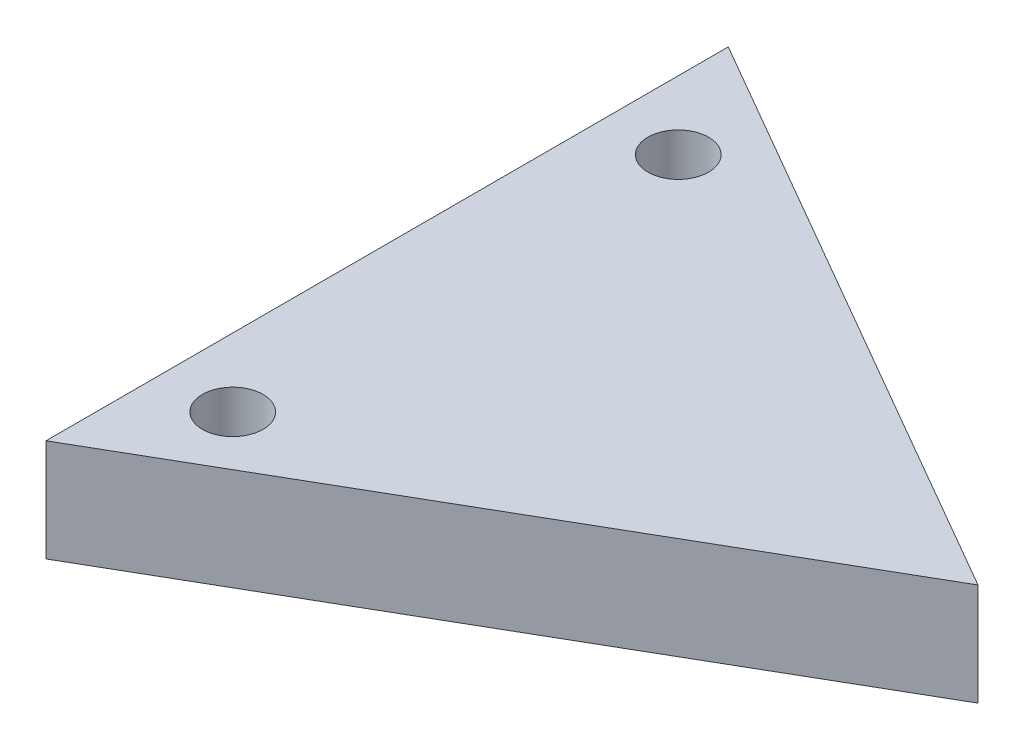
ISO-10303-21;
HEADER;
FILE_DESCRIPTION(('STEP AP214'),'2;1');
FILE_NAME('part.step','',(''),(''),'','','');
FILE_SCHEMA(('AUTOMOTIVE_DESIGN { 1 0 10303 214 1 1 1 1 }'));
ENDSEC;
DATA;
#1=APPLICATION_CONTEXT('core data for automotive mechanical design processes');
#2=APPLICATION_PROTOCOL_DEFINITION('international standard','automotive_design',2000,#1);
#3=PRODUCT_CONTEXT('',#1,'mechanical');
#4=PRODUCT('Part','Part','',(#3));
#5=PRODUCT_RELATED_PRODUCT_CATEGORY('part','',(#4));
#6=PRODUCT_DEFINITION_FORMATION('','',#4);
#7=PRODUCT_DEFINITION_CONTEXT('part definition',#1,'design');
#8=PRODUCT_DEFINITION('design','',#6,#7);
#9=PRODUCT_DEFINITION_SHAPE('','',#8);
#10=(LENGTH_UNIT() NAMED_UNIT(*) SI_UNIT(.MILLI.,.METRE.));
#11=(NAMED_UNIT(*) PLANE_ANGLE_UNIT() SI_UNIT($,.RADIAN.));
#12=(NAMED_UNIT(*) SI_UNIT($,.STERADIAN.) SOLID_ANGLE_UNIT());
#13=UNCERTAINTY_MEASURE_WITH_UNIT(LENGTH_MEASURE(1.E-05),#10,'distance_accuracy_value','');
#14=(GEOMETRIC_REPRESENTATION_CONTEXT(3) GLOBAL_UNCERTAINTY_ASSIGNED_CONTEXT((#13)) GLOBAL_UNIT_ASSIGNED_CONTEXT((#10,
#11,#12)) REPRESENTATION_CONTEXT('',''));
#15=CARTESIAN_POINT('',(0.,0.,0.));
#16=DIRECTION('',(0.,0.,1.));
#17=DIRECTION('',(1.,0.,0.));
#18=AXIS2_PLACEMENT_3D('',#15,#16,#17);
#19=CARTESIAN_POINT('',(-5.77350269189626,3.,10.));
#20=DIRECTION('',(-0.5,0.,-0.866025403784439));
#21=DIRECTION('',(-0.866025403784439,0.,0.5));
#22=AXIS2_PLACEMENT_3D('',#19,#20,#21);
#23=PLANE('',#22);
#24=DIRECTION('',(0.866025403784438,0.,-0.5));
#25=VECTOR('',#24,1.);
#26=CARTESIAN_POINT('',(-5.77350269189626,0.,10.));
#27=LINE('',#26,#25);
#28=CARTESIAN_POINT('',(-5.77350269189626,0.,10.));
#29=VERTEX_POINT('',#28);
#30=CARTESIAN_POINT('',(11.5470053837925,0.,0.));
#31=VERTEX_POINT('',#30);
#32=EDGE_CURVE('E79',#29,#31,#27,.T.);
#33=ORIENTED_EDGE('',*,*,#32,.T.);
#34=DIRECTION('',(0.,-1.,0.));
#35=VECTOR('',#34,1.);
#36=CARTESIAN_POINT('',(11.5470053837925,3.,0.));
#37=LINE('',#36,#35);
#38=CARTESIAN_POINT('',(11.5470053837925,3.,0.));
#39=VERTEX_POINT('',#38);
#40=EDGE_CURVE('E11',#39,#31,#37,.T.);
#41=ORIENTED_EDGE('',*,*,#40,.F.);
#42=DIRECTION('',(0.866025403784438,0.,-0.5));
#43=VECTOR('',#42,1.);
#44=CARTESIAN_POINT('',(-5.77350269189626,3.,10.));
#45=LINE('',#44,#43);
#46=CARTESIAN_POINT('',(-5.77350269189626,3.,10.));
#47=VERTEX_POINT('',#46);
#48=EDGE_CURVE('E72',#47,#39,#45,.T.);
#49=ORIENTED_EDGE('',*,*,#48,.F.);
#50=DIRECTION('',(0.,-1.,0.));
#51=VECTOR('',#50,1.);
#52=CARTESIAN_POINT('',(-5.77350269189626,3.,10.));
#53=LINE('',#52,#51);
#54=EDGE_CURVE('E80',#47,#29,#53,.T.);
#55=ORIENTED_EDGE('',*,*,#54,.T.);
#56=EDGE_LOOP('',(#33,#41,#49,#55));
#57=FACE_BOUND('',#56,.T.);
#58=ADVANCED_FACE('F30',(#57),#23,.F.);
#59=CARTESIAN_POINT('',(11.5470053837925,3.,0.));
#60=DIRECTION('',(-0.5,0.,0.866025403784439));
#61=DIRECTION('',(0.866025403784439,0.,0.5));
#62=AXIS2_PLACEMENT_3D('',#59,#60,#61);
#63=PLANE('',#62);
#64=DIRECTION('',(-0.866025403784439,0.,-0.5));
#65=VECTOR('',#64,1.);
#66=CARTESIAN_POINT('',(11.5470053837925,0.,0.));
#67=LINE('',#66,#65);
#68=CARTESIAN_POINT('',(-5.77350269189626,0.,-10.));
#69=VERTEX_POINT('',#68);
#70=EDGE_CURVE('E60',#31,#69,#67,.T.);
#71=ORIENTED_EDGE('',*,*,#70,.T.);
#72=DIRECTION('',(0.,-1.,0.));
#73=VECTOR('',#72,1.);
#74=CARTESIAN_POINT('',(-5.77350269189626,3.,-10.));
#75=LINE('',#74,#73);
#76=CARTESIAN_POINT('',(-5.77350269189626,3.,-10.));
#77=VERTEX_POINT('',#76);
#78=EDGE_CURVE('E39',#77,#69,#75,.T.);
#79=ORIENTED_EDGE('',*,*,#78,.F.);
#80=DIRECTION('',(-0.866025403784439,0.,-0.5));
#81=VECTOR('',#80,1.);
#82=CARTESIAN_POINT('',(11.5470053837925,3.,0.));
#83=LINE('',#82,#81);
#84=EDGE_CURVE('E68',#39,#77,#83,.T.);
#85=ORIENTED_EDGE('',*,*,#84,.F.);
#86=ORIENTED_EDGE('',*,*,#40,.T.);
#87=EDGE_LOOP('',(#71,#79,#85,#86));
#88=FACE_BOUND('',#87,.T.);
#89=ADVANCED_FACE('F69',(#88),#63,.F.);
#90=CARTESIAN_POINT('',(-5.77350269189626,3.,-10.));
#91=DIRECTION('',(1.,0.,0.));
#92=DIRECTION('',(0.,0.,-1.));
#93=AXIS2_PLACEMENT_3D('',#90,#91,#92);
#94=PLANE('',#93);
#95=DIRECTION('',(0.,0.,1.));
#96=VECTOR('',#95,1.);
#97=CARTESIAN_POINT('',(-5.77350269189626,0.,-10.));
#98=LINE('',#97,#96);
#99=EDGE_CURVE('E65',#69,#29,#98,.T.);
#100=ORIENTED_EDGE('',*,*,#99,.T.);
#101=ORIENTED_EDGE('',*,*,#54,.F.);
#102=DIRECTION('',(0.,0.,1.));
#103=VECTOR('',#102,1.);
#104=CARTESIAN_POINT('',(-5.77350269189626,3.,-10.));
#105=LINE('',#104,#103);
#106=EDGE_CURVE('E48',#77,#47,#105,.T.);
#107=ORIENTED_EDGE('',*,*,#106,.F.);
#108=ORIENTED_EDGE('',*,*,#78,.T.);
#109=EDGE_LOOP('',(#100,#101,#107,#108));
#110=FACE_BOUND('',#109,.T.);
#111=ADVANCED_FACE('F91',(#110),#94,.F.);
#112=CARTESIAN_POINT('',(11.5470053837925,3.,0.));
#113=DIRECTION('',(0.,1.,0.));
#114=DIRECTION('',(0.,0.,1.));
#115=AXIS2_PLACEMENT_3D('',#112,#113,#114);
#116=PLANE('',#115);
#117=CARTESIAN_POINT('',(-3.77,3.,6.53));
#118=DIRECTION('',(0.,1.,0.));
#119=DIRECTION('',(0.,0.,1.));
#120=AXIS2_PLACEMENT_3D('',#117,#118,#119);
#121=CIRCLE('',#120,0.888999999999989);
#122=CARTESIAN_POINT('',(-3.77,3.,7.41899999999999));
#123=VERTEX_POINT('',#122);
#124=EDGE_CURVE('E148',#123,#123,#121,.T.);
#125=ORIENTED_EDGE('',*,*,#124,.F.);
#126=EDGE_LOOP('',(#125));
#127=FACE_BOUND('',#126,.T.);
#128=CARTESIAN_POINT('',(-3.77,3.,-6.53));
#129=DIRECTION('',(0.,1.,0.));
#130=DIRECTION('',(0.,0.,1.));
#131=AXIS2_PLACEMENT_3D('',#128,#129,#130);
#132=CIRCLE('',#131,0.888999999999989);
#133=CARTESIAN_POINT('',(-3.77,3.,-5.64100000000001));
#134=VERTEX_POINT('',#133);
#135=EDGE_CURVE('E86',#134,#134,#132,.T.);
#136=ORIENTED_EDGE('',*,*,#135,.F.);
#137=EDGE_LOOP('',(#136));
#138=FACE_BOUND('',#137,.T.);
#139=ORIENTED_EDGE('',*,*,#48,.T.);
#140=ORIENTED_EDGE('',*,*,#84,.T.);
#141=ORIENTED_EDGE('',*,*,#106,.T.);
#142=EDGE_LOOP('',(#139,#140,#141));
#143=FACE_BOUND('',#142,.T.);
#144=ADVANCED_FACE('F75',(#127,#138,#143),#116,.T.);
#145=CARTESIAN_POINT('',(11.5470053837925,0.,0.));
#146=DIRECTION('',(0.,1.,0.));
#147=DIRECTION('',(0.,0.,1.));
#148=AXIS2_PLACEMENT_3D('',#145,#146,#147);
#149=PLANE('',#148);
#150=CARTESIAN_POINT('',(-3.77,0.,6.53));
#151=DIRECTION('',(0.,1.,0.));
#152=DIRECTION('',(0.,0.,1.));
#153=AXIS2_PLACEMENT_3D('',#150,#151,#152);
#154=CIRCLE('',#153,0.888999999999994);
#155=CARTESIAN_POINT('',(-3.77,0.,7.41899999999999));
#156=VERTEX_POINT('',#155);
#157=EDGE_CURVE('E33',#156,#156,#154,.T.);
#158=ORIENTED_EDGE('',*,*,#157,.T.);
#159=EDGE_LOOP('',(#158));
#160=FACE_BOUND('',#159,.T.);
#161=CARTESIAN_POINT('',(-3.77,0.,-6.53));
#162=DIRECTION('',(0.,1.,0.));
#163=DIRECTION('',(0.,0.,1.));
#164=AXIS2_PLACEMENT_3D('',#161,#162,#163);
#165=CIRCLE('',#164,0.888999999999994);
#166=CARTESIAN_POINT('',(-3.77,0.,-5.64100000000001));
#167=VERTEX_POINT('',#166);
#168=EDGE_CURVE('E82',#167,#167,#165,.T.);
#169=ORIENTED_EDGE('',*,*,#168,.T.);
#170=EDGE_LOOP('',(#169));
#171=FACE_BOUND('',#170,.T.);
#172=ORIENTED_EDGE('',*,*,#32,.F.);
#173=ORIENTED_EDGE('',*,*,#99,.F.);
#174=ORIENTED_EDGE('',*,*,#70,.F.);
#175=EDGE_LOOP('',(#172,#173,#174));
#176=FACE_BOUND('',#175,.T.);
#177=ADVANCED_FACE('F92',(#160,#171,#176),#149,.F.);
#178=CARTESIAN_POINT('',(-3.77,3.,-6.53));
#179=DIRECTION('',(0.,1.,0.));
#180=DIRECTION('',(0.,0.,1.));
#181=AXIS2_PLACEMENT_3D('',#178,#179,#180);
#182=CYLINDRICAL_SURFACE('',#181,0.888999999999994);
#183=ORIENTED_EDGE('',*,*,#135,.T.);
#184=EDGE_LOOP('',(#183));
#185=FACE_BOUND('',#184,.T.);
#186=ORIENTED_EDGE('',*,*,#168,.F.);
#187=EDGE_LOOP('',(#186));
#188=FACE_BOUND('',#187,.T.);
#189=ADVANCED_FACE('F94',(#185,#188),#182,.F.);
#190=CARTESIAN_POINT('',(-3.77,3.,6.53));
#191=DIRECTION('',(0.,1.,0.));
#192=DIRECTION('',(0.,0.,1.));
#193=AXIS2_PLACEMENT_3D('',#190,#191,#192);
#194=CYLINDRICAL_SURFACE('',#193,0.888999999999994);
#195=ORIENTED_EDGE('',*,*,#124,.T.);
#196=EDGE_LOOP('',(#195));
#197=FACE_BOUND('',#196,.T.);
#198=ORIENTED_EDGE('',*,*,#157,.F.);
#199=EDGE_LOOP('',(#198));
#200=FACE_BOUND('',#199,.T.);
#201=ADVANCED_FACE('F101',(#197,#200),#194,.F.);
#202=CLOSED_SHELL('',(#58,#89,#111,#144,#177,#189,#201));
#203=MANIFOLD_SOLID_BREP('B2',#202);
#204=ADVANCED_BREP_SHAPE_REPRESENTATION('',(#18,#203),#14);
#205=SHAPE_DEFINITION_REPRESENTATION(#9,#204);
ENDSEC;
END-ISO-10303-21;
